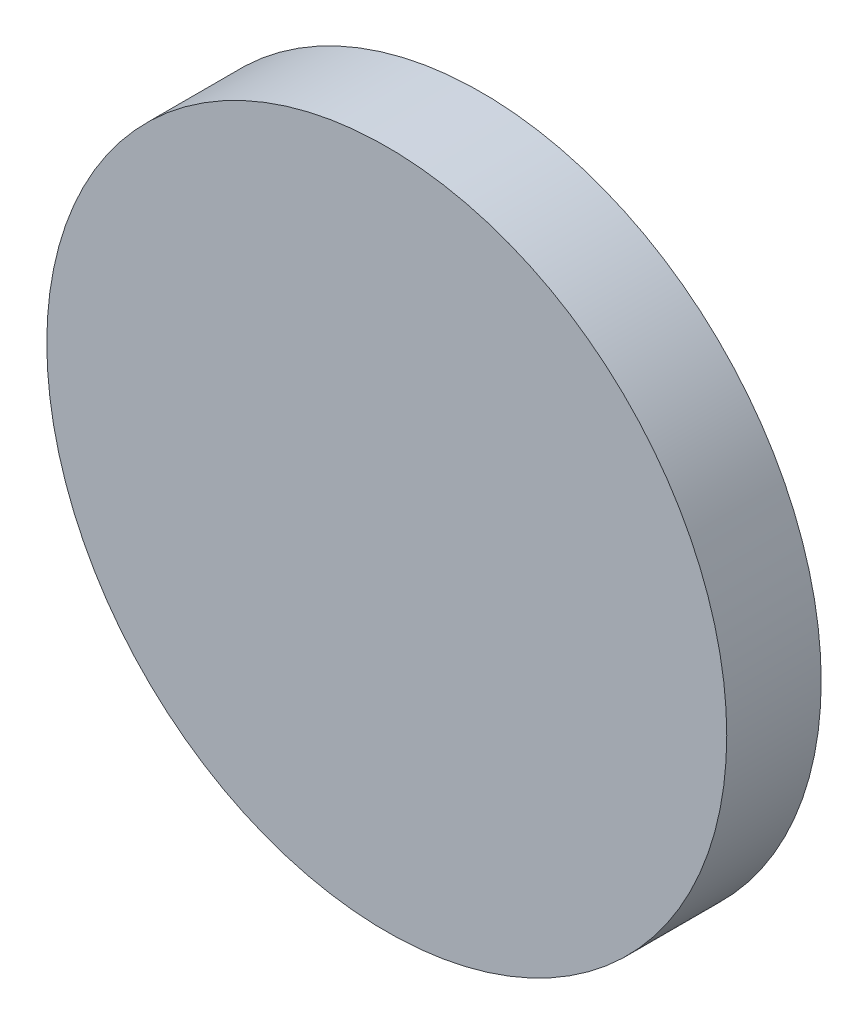
ISO-10303-21;
HEADER;
FILE_DESCRIPTION(('STEP AP214'),'2;1');
FILE_NAME('part.step','',(''),(''),'','','');
FILE_SCHEMA(('AUTOMOTIVE_DESIGN { 1 0 10303 214 1 1 1 1 }'));
ENDSEC;
DATA;
#1=APPLICATION_CONTEXT('core data for automotive mechanical design processes');
#2=APPLICATION_PROTOCOL_DEFINITION('international standard','automotive_design',2000,#1);
#3=PRODUCT_CONTEXT('',#1,'mechanical');
#4=PRODUCT('Part','Part','',(#3));
#5=PRODUCT_RELATED_PRODUCT_CATEGORY('part','',(#4));
#6=PRODUCT_DEFINITION_FORMATION('','',#4);
#7=PRODUCT_DEFINITION_CONTEXT('part definition',#1,'design');
#8=PRODUCT_DEFINITION('design','',#6,#7);
#9=PRODUCT_DEFINITION_SHAPE('','',#8);
#10=(LENGTH_UNIT() NAMED_UNIT(*) SI_UNIT(.MILLI.,.METRE.));
#11=(NAMED_UNIT(*) PLANE_ANGLE_UNIT() SI_UNIT($,.RADIAN.));
#12=(NAMED_UNIT(*) SI_UNIT($,.STERADIAN.) SOLID_ANGLE_UNIT());
#13=UNCERTAINTY_MEASURE_WITH_UNIT(LENGTH_MEASURE(1.E-05),#10,'distance_accuracy_value','');
#14=(GEOMETRIC_REPRESENTATION_CONTEXT(3) GLOBAL_UNCERTAINTY_ASSIGNED_CONTEXT((#13)) GLOBAL_UNIT_ASSIGNED_CONTEXT((#10,
#11,#12)) REPRESENTATION_CONTEXT('',''));
#15=CARTESIAN_POINT('',(0.,0.,0.));
#16=DIRECTION('',(0.,0.,1.));
#17=DIRECTION('',(1.,0.,0.));
#18=AXIS2_PLACEMENT_3D('',#15,#16,#17);
#19=CARTESIAN_POINT('',(0.,0.,10.));
#20=DIRECTION('',(0.,0.,-1.));
#21=DIRECTION('',(-1.,0.,0.));
#22=AXIS2_PLACEMENT_3D('',#19,#20,#21);
#23=CYLINDRICAL_SURFACE('',#22,36.);
#24=CARTESIAN_POINT('',(0.,0.,10.));
#25=DIRECTION('',(0.,0.,1.));
#26=DIRECTION('',(1.,0.,0.));
#27=AXIS2_PLACEMENT_3D('',#24,#25,#26);
#28=CIRCLE('',#27,36.);
#29=CARTESIAN_POINT('',(36.,0.,10.));
#30=VERTEX_POINT('',#29);
#31=EDGE_CURVE('E10',#30,#30,#28,.T.);
#32=ORIENTED_EDGE('',*,*,#31,.F.);
#33=EDGE_LOOP('',(#32));
#34=FACE_BOUND('',#33,.T.);
#35=CARTESIAN_POINT('',(0.,0.,0.));
#36=DIRECTION('',(0.,0.,1.));
#37=DIRECTION('',(1.,0.,0.));
#38=AXIS2_PLACEMENT_3D('',#35,#36,#37);
#39=CIRCLE('',#38,36.);
#40=CARTESIAN_POINT('',(36.,0.,0.));
#41=VERTEX_POINT('',#40);
#42=EDGE_CURVE('E34',#41,#41,#39,.T.);
#43=ORIENTED_EDGE('',*,*,#42,.T.);
#44=EDGE_LOOP('',(#43));
#45=FACE_BOUND('',#44,.T.);
#46=ADVANCED_FACE('F31',(#34,#45),#23,.T.);
#47=CARTESIAN_POINT('',(0.,0.,10.));
#48=DIRECTION('',(0.,0.,1.));
#49=DIRECTION('',(1.,0.,0.));
#50=AXIS2_PLACEMENT_3D('',#47,#48,#49);
#51=PLANE('',#50);
#52=ORIENTED_EDGE('',*,*,#31,.T.);
#53=EDGE_LOOP('',(#52));
#54=FACE_BOUND('',#53,.T.);
#55=ADVANCED_FACE('F46',(#54),#51,.T.);
#56=CARTESIAN_POINT('',(0.,0.,0.));
#57=DIRECTION('',(0.,0.,1.));
#58=DIRECTION('',(1.,0.,0.));
#59=AXIS2_PLACEMENT_3D('',#56,#57,#58);
#60=PLANE('',#59);
#61=ORIENTED_EDGE('',*,*,#42,.F.);
#62=EDGE_LOOP('',(#61));
#63=FACE_BOUND('',#62,.T.);
#64=ADVANCED_FACE('F44',(#63),#60,.F.);
#65=CLOSED_SHELL('',(#46,#55,#64));
#66=MANIFOLD_SOLID_BREP('B2',#65);
#67=ADVANCED_BREP_SHAPE_REPRESENTATION('',(#18,#66),#14);
#68=SHAPE_DEFINITION_REPRESENTATION(#9,#67);
ENDSEC;
END-ISO-10303-21;
